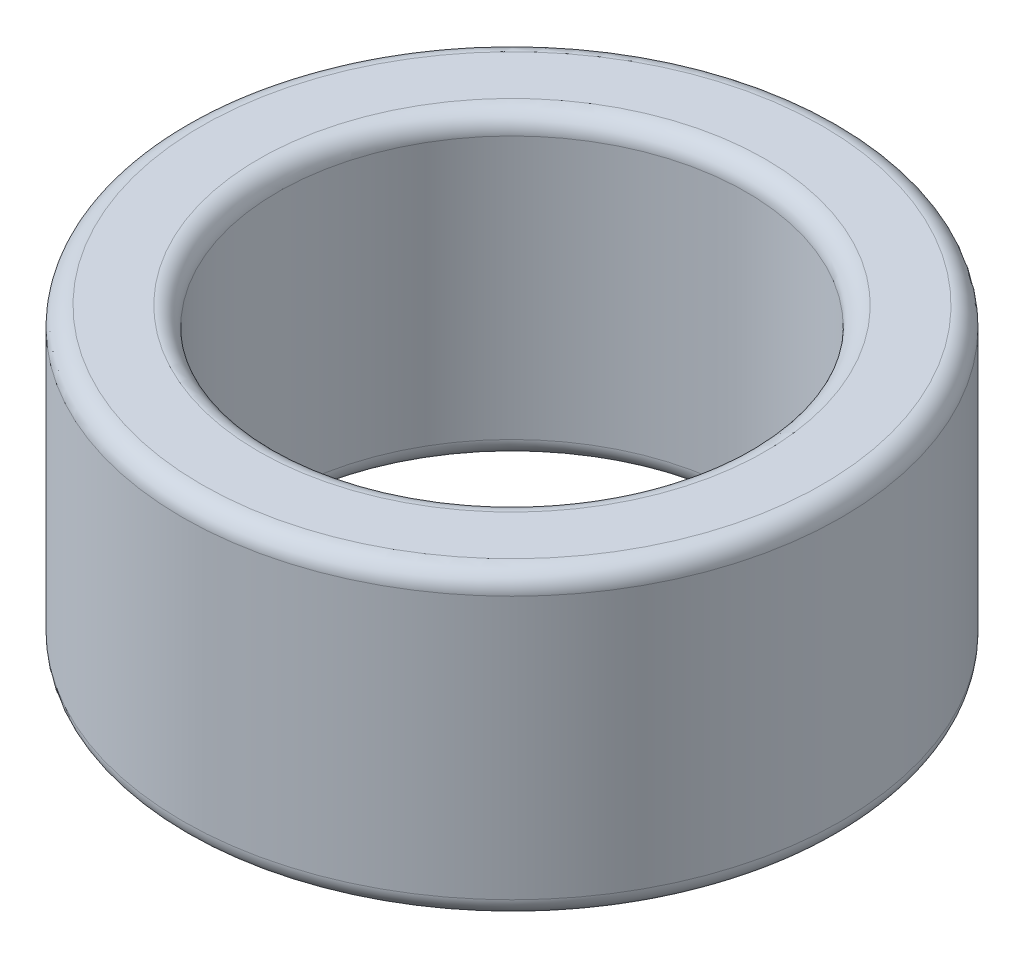
ISO-10303-21;
HEADER;
FILE_DESCRIPTION(('STEP AP214'),'2;1');
FILE_NAME('part.step','',(''),(''),'','','');
FILE_SCHEMA(('AUTOMOTIVE_DESIGN { 1 0 10303 214 1 1 1 1 }'));
ENDSEC;
DATA;
#1=APPLICATION_CONTEXT('core data for automotive mechanical design processes');
#2=APPLICATION_PROTOCOL_DEFINITION('international standard','automotive_design',2000,#1);
#3=PRODUCT_CONTEXT('',#1,'mechanical');
#4=PRODUCT('Part','Part','',(#3));
#5=PRODUCT_RELATED_PRODUCT_CATEGORY('part','',(#4));
#6=PRODUCT_DEFINITION_FORMATION('','',#4);
#7=PRODUCT_DEFINITION_CONTEXT('part definition',#1,'design');
#8=PRODUCT_DEFINITION('design','',#6,#7);
#9=PRODUCT_DEFINITION_SHAPE('','',#8);
#10=(LENGTH_UNIT() NAMED_UNIT(*) SI_UNIT(.MILLI.,.METRE.));
#11=(NAMED_UNIT(*) PLANE_ANGLE_UNIT() SI_UNIT($,.RADIAN.));
#12=(NAMED_UNIT(*) SI_UNIT($,.STERADIAN.) SOLID_ANGLE_UNIT());
#13=UNCERTAINTY_MEASURE_WITH_UNIT(LENGTH_MEASURE(1.E-05),#10,'distance_accuracy_value','');
#14=(GEOMETRIC_REPRESENTATION_CONTEXT(3) GLOBAL_UNCERTAINTY_ASSIGNED_CONTEXT((#13)) GLOBAL_UNIT_ASSIGNED_CONTEXT((#10,
#11,#12)) REPRESENTATION_CONTEXT('',''));
#15=CARTESIAN_POINT('',(0.,0.,0.));
#16=DIRECTION('',(0.,0.,1.));
#17=DIRECTION('',(1.,0.,0.));
#18=AXIS2_PLACEMENT_3D('',#15,#16,#17);
#19=CARTESIAN_POINT('',(0.,2.0066,0.));
#20=DIRECTION('',(0.,1.,0.));
#21=DIRECTION('',(0.,0.,1.));
#22=AXIS2_PLACEMENT_3D('',#19,#20,#21);
#23=PLANE('',#22);
#24=CARTESIAN_POINT('',(0.,2.0066,0.));
#25=DIRECTION('',(0.,1.,0.));
#26=DIRECTION('',(0.,0.,1.));
#27=AXIS2_PLACEMENT_3D('',#24,#25,#26);
#28=CIRCLE('',#27,1.6891);
#29=CARTESIAN_POINT('',(0.,2.0066,1.6891));
#30=VERTEX_POINT('',#29);
#31=EDGE_CURVE('E61',#30,#30,#28,.F.);
#32=ORIENTED_EDGE('',*,*,#31,.T.);
#33=EDGE_LOOP('',(#32));
#34=FACE_BOUND('',#33,.T.);
#35=CARTESIAN_POINT('',(0.,2.0066,0.));
#36=DIRECTION('',(0.,1.,0.));
#37=DIRECTION('',(0.,0.,1.));
#38=AXIS2_PLACEMENT_3D('',#35,#36,#37);
#39=CIRCLE('',#38,2.0701);
#40=CARTESIAN_POINT('',(0.,2.0066,2.0701));
#41=VERTEX_POINT('',#40);
#42=EDGE_CURVE('E65',#41,#41,#39,.T.);
#43=ORIENTED_EDGE('',*,*,#42,.T.);
#44=EDGE_LOOP('',(#43));
#45=FACE_BOUND('',#44,.T.);
#46=ADVANCED_FACE('F37',(#34,#45),#23,.T.);
#47=CARTESIAN_POINT('',(0.,0.,0.));
#48=DIRECTION('',(0.,1.,0.));
#49=DIRECTION('',(0.,0.,1.));
#50=AXIS2_PLACEMENT_3D('',#47,#48,#49);
#51=PLANE('',#50);
#52=CARTESIAN_POINT('',(0.,0.,0.));
#53=DIRECTION('',(0.,1.,0.));
#54=DIRECTION('',(0.,0.,1.));
#55=AXIS2_PLACEMENT_3D('',#52,#53,#54);
#56=CIRCLE('',#55,1.6891);
#57=CARTESIAN_POINT('',(0.,0.,1.6891));
#58=VERTEX_POINT('',#57);
#59=EDGE_CURVE('E10',#58,#58,#56,.T.);
#60=ORIENTED_EDGE('',*,*,#59,.T.);
#61=EDGE_LOOP('',(#60));
#62=FACE_BOUND('',#61,.T.);
#63=CARTESIAN_POINT('',(0.,0.,0.));
#64=DIRECTION('',(0.,1.,0.));
#65=DIRECTION('',(0.,0.,1.));
#66=AXIS2_PLACEMENT_3D('',#63,#64,#65);
#67=CIRCLE('',#66,2.0701);
#68=CARTESIAN_POINT('',(0.,0.,2.0701));
#69=VERTEX_POINT('',#68);
#70=EDGE_CURVE('E45',#69,#69,#67,.F.);
#71=ORIENTED_EDGE('',*,*,#70,.T.);
#72=EDGE_LOOP('',(#71));
#73=FACE_BOUND('',#72,.T.);
#74=ADVANCED_FACE('F93',(#62,#73),#51,.F.);
#75=CARTESIAN_POINT('',(0.,2.0066,0.));
#76=DIRECTION('',(0.,-1.,0.));
#77=DIRECTION('',(0.,0.,-1.));
#78=AXIS2_PLACEMENT_3D('',#75,#76,#77);
#79=CYLINDRICAL_SURFACE('',#78,2.1971);
#80=CARTESIAN_POINT('',(0.,1.8796,0.));
#81=DIRECTION('',(0.,1.,0.));
#82=DIRECTION('',(0.,0.,1.));
#83=AXIS2_PLACEMENT_3D('',#80,#81,#82);
#84=CIRCLE('',#83,2.1971);
#85=CARTESIAN_POINT('',(0.,1.8796,2.1971));
#86=VERTEX_POINT('',#85);
#87=EDGE_CURVE('E50',#86,#86,#84,.F.);
#88=ORIENTED_EDGE('',*,*,#87,.T.);
#89=EDGE_LOOP('',(#88));
#90=FACE_BOUND('',#89,.T.);
#91=CARTESIAN_POINT('',(0.,0.127,0.));
#92=DIRECTION('',(0.,1.,0.));
#93=DIRECTION('',(0.,0.,1.));
#94=AXIS2_PLACEMENT_3D('',#91,#92,#93);
#95=CIRCLE('',#94,2.1971);
#96=CARTESIAN_POINT('',(0.,0.127,2.1971));
#97=VERTEX_POINT('',#96);
#98=EDGE_CURVE('E55',#97,#97,#95,.T.);
#99=ORIENTED_EDGE('',*,*,#98,.T.);
#100=EDGE_LOOP('',(#99));
#101=FACE_BOUND('',#100,.T.);
#102=ADVANCED_FACE('F99',(#90,#101),#79,.T.);
#103=CARTESIAN_POINT('',(0.,2.0066,0.));
#104=DIRECTION('',(0.,-1.,0.));
#105=DIRECTION('',(0.,0.,-1.));
#106=AXIS2_PLACEMENT_3D('',#103,#104,#105);
#107=CYLINDRICAL_SURFACE('',#106,1.5621);
#108=CARTESIAN_POINT('',(0.,1.8796,0.));
#109=DIRECTION('',(0.,1.,0.));
#110=DIRECTION('',(0.,0.,1.));
#111=AXIS2_PLACEMENT_3D('',#108,#109,#110);
#112=CIRCLE('',#111,1.5621);
#113=CARTESIAN_POINT('',(0.,1.8796,1.5621));
#114=VERTEX_POINT('',#113);
#115=EDGE_CURVE('E69',#114,#114,#112,.T.);
#116=ORIENTED_EDGE('',*,*,#115,.T.);
#117=EDGE_LOOP('',(#116));
#118=FACE_BOUND('',#117,.T.);
#119=CARTESIAN_POINT('',(0.,0.127,0.));
#120=DIRECTION('',(0.,1.,0.));
#121=DIRECTION('',(0.,0.,1.));
#122=AXIS2_PLACEMENT_3D('',#119,#120,#121);
#123=CIRCLE('',#122,1.5621);
#124=CARTESIAN_POINT('',(0.,0.127,1.5621));
#125=VERTEX_POINT('',#124);
#126=EDGE_CURVE('E73',#125,#125,#123,.F.);
#127=ORIENTED_EDGE('',*,*,#126,.T.);
#128=EDGE_LOOP('',(#127));
#129=FACE_BOUND('',#128,.T.);
#130=ADVANCED_FACE('F78',(#118,#129),#107,.F.);
#131=CARTESIAN_POINT('',(0.,1.8796,0.));
#132=DIRECTION('',(0.,1.,0.));
#133=DIRECTION('',(0.,0.,1.));
#134=AXIS2_PLACEMENT_3D('',#131,#132,#133);
#135=TOROIDAL_SURFACE('',#134,1.6891,0.127);
#136=ORIENTED_EDGE('',*,*,#31,.F.);
#137=EDGE_LOOP('',(#136));
#138=FACE_BOUND('',#137,.T.);
#139=ORIENTED_EDGE('',*,*,#115,.F.);
#140=EDGE_LOOP('',(#139));
#141=FACE_BOUND('',#140,.T.);
#142=ADVANCED_FACE('F89',(#138,#141),#135,.T.);
#143=CARTESIAN_POINT('',(0.,1.8796,0.));
#144=DIRECTION('',(0.,1.,0.));
#145=DIRECTION('',(0.,0.,1.));
#146=AXIS2_PLACEMENT_3D('',#143,#144,#145);
#147=TOROIDAL_SURFACE('',#146,2.0701,0.127);
#148=ORIENTED_EDGE('',*,*,#87,.F.);
#149=EDGE_LOOP('',(#148));
#150=FACE_BOUND('',#149,.T.);
#151=ORIENTED_EDGE('',*,*,#42,.F.);
#152=EDGE_LOOP('',(#151));
#153=FACE_BOUND('',#152,.T.);
#154=ADVANCED_FACE('F83',(#150,#153),#147,.T.);
#155=CARTESIAN_POINT('',(0.,0.127,0.));
#156=DIRECTION('',(0.,1.,0.));
#157=DIRECTION('',(0.,0.,1.));
#158=AXIS2_PLACEMENT_3D('',#155,#156,#157);
#159=TOROIDAL_SURFACE('',#158,1.6891,0.127);
#160=ORIENTED_EDGE('',*,*,#126,.F.);
#161=EDGE_LOOP('',(#160));
#162=FACE_BOUND('',#161,.T.);
#163=ORIENTED_EDGE('',*,*,#59,.F.);
#164=EDGE_LOOP('',(#163));
#165=FACE_BOUND('',#164,.T.);
#166=ADVANCED_FACE('F80',(#162,#165),#159,.T.);
#167=CARTESIAN_POINT('',(0.,0.127,0.));
#168=DIRECTION('',(0.,1.,0.));
#169=DIRECTION('',(0.,0.,1.));
#170=AXIS2_PLACEMENT_3D('',#167,#168,#169);
#171=TOROIDAL_SURFACE('',#170,2.0701,0.127);
#172=ORIENTED_EDGE('',*,*,#70,.F.);
#173=EDGE_LOOP('',(#172));
#174=FACE_BOUND('',#173,.T.);
#175=ORIENTED_EDGE('',*,*,#98,.F.);
#176=EDGE_LOOP('',(#175));
#177=FACE_BOUND('',#176,.T.);
#178=ADVANCED_FACE('F39',(#174,#177),#171,.T.);
#179=CLOSED_SHELL('',(#46,#74,#102,#130,#142,#154,#166,#178));
#180=MANIFOLD_SOLID_BREP('B2',#179);
#181=ADVANCED_BREP_SHAPE_REPRESENTATION('',(#18,#180),#14);
#182=SHAPE_DEFINITION_REPRESENTATION(#9,#181);
ENDSEC;
END-ISO-10303-21;
